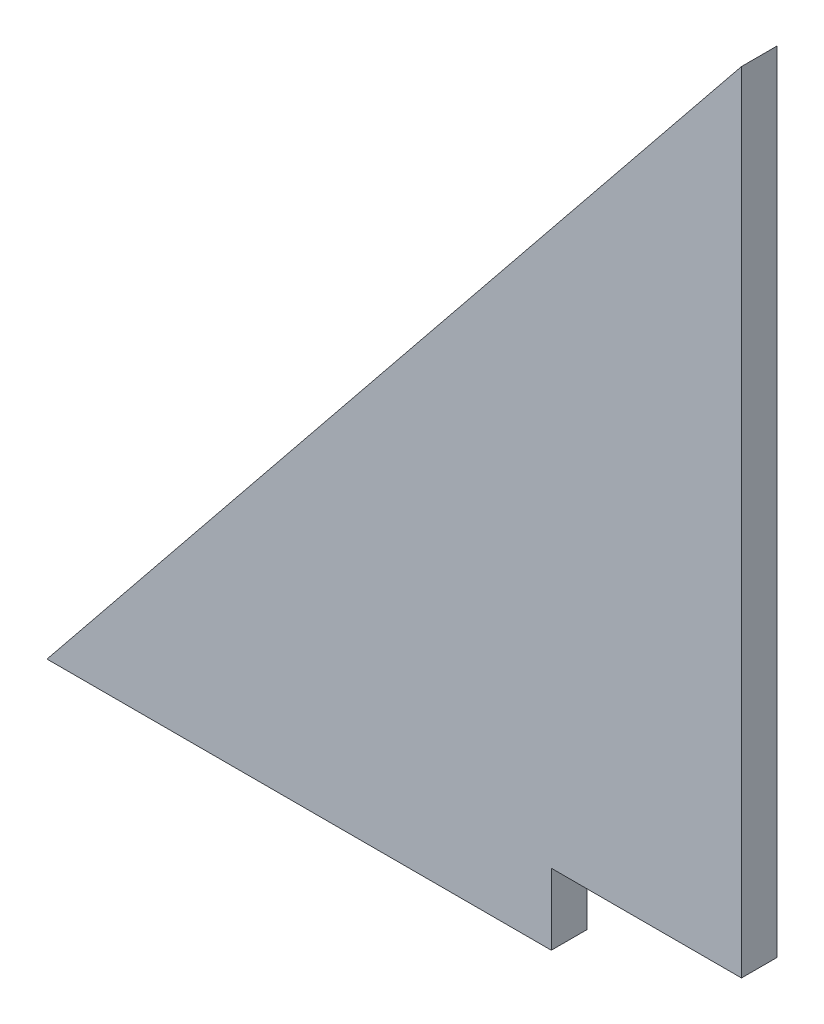
ISO-10303-21;
HEADER;
FILE_DESCRIPTION(('STEP AP214'),'2;1');
FILE_NAME('part.step','',(''),(''),'','','');
FILE_SCHEMA(('AUTOMOTIVE_DESIGN { 1 0 10303 214 1 1 1 1 }'));
ENDSEC;
DATA;
#1=APPLICATION_CONTEXT('core data for automotive mechanical design processes');
#2=APPLICATION_PROTOCOL_DEFINITION('international standard','automotive_design',2000,#1);
#3=PRODUCT_CONTEXT('',#1,'mechanical');
#4=PRODUCT('Part','Part','',(#3));
#5=PRODUCT_RELATED_PRODUCT_CATEGORY('part','',(#4));
#6=PRODUCT_DEFINITION_FORMATION('','',#4);
#7=PRODUCT_DEFINITION_CONTEXT('part definition',#1,'design');
#8=PRODUCT_DEFINITION('design','',#6,#7);
#9=PRODUCT_DEFINITION_SHAPE('','',#8);
#10=(LENGTH_UNIT() NAMED_UNIT(*) SI_UNIT(.MILLI.,.METRE.));
#11=(NAMED_UNIT(*) PLANE_ANGLE_UNIT() SI_UNIT($,.RADIAN.));
#12=(NAMED_UNIT(*) SI_UNIT($,.STERADIAN.) SOLID_ANGLE_UNIT());
#13=UNCERTAINTY_MEASURE_WITH_UNIT(LENGTH_MEASURE(1.E-05),#10,'distance_accuracy_value','');
#14=(GEOMETRIC_REPRESENTATION_CONTEXT(3) GLOBAL_UNCERTAINTY_ASSIGNED_CONTEXT((#13)) GLOBAL_UNIT_ASSIGNED_CONTEXT((#10,
#11,#12)) REPRESENTATION_CONTEXT('',''));
#15=CARTESIAN_POINT('',(0.,0.,0.));
#16=DIRECTION('',(0.,0.,1.));
#17=DIRECTION('',(1.,0.,0.));
#18=AXIS2_PLACEMENT_3D('',#15,#16,#17);
#19=CARTESIAN_POINT('',(0.0780344562762211,-36.9367393336946,3.175));
#20=DIRECTION('',(-1.,0.,0.));
#21=DIRECTION('',(0.,0.,1.));
#22=AXIS2_PLACEMENT_3D('',#19,#20,#21);
#23=PLANE('',#22);
#24=DIRECTION('',(0.,1.,0.));
#25=VECTOR('',#24,1.);
#26=CARTESIAN_POINT('',(0.0780344562762211,-36.9367393336946,0.));
#27=LINE('',#26,#25);
#28=CARTESIAN_POINT('',(0.0780344562762211,-36.9367393336946,0.));
#29=VERTEX_POINT('',#28);
#30=CARTESIAN_POINT('',(0.0780344562762211,33.6228260869565,0.));
#31=VERTEX_POINT('',#30);
#32=EDGE_CURVE('E112',#29,#31,#27,.T.);
#33=ORIENTED_EDGE('',*,*,#32,.T.);
#34=DIRECTION('',(0.,0.,-1.));
#35=VECTOR('',#34,1.);
#36=CARTESIAN_POINT('',(0.0780344562762211,33.6228260869565,3.175));
#37=LINE('',#36,#35);
#38=CARTESIAN_POINT('',(0.0780344562762211,33.6228260869565,3.175));
#39=VERTEX_POINT('',#38);
#40=EDGE_CURVE('E42',#39,#31,#37,.T.);
#41=ORIENTED_EDGE('',*,*,#40,.F.);
#42=DIRECTION('',(0.,1.,0.));
#43=VECTOR('',#42,1.);
#44=CARTESIAN_POINT('',(0.0780344562762211,-36.9367393336946,3.175));
#45=LINE('',#44,#43);
#46=CARTESIAN_POINT('',(0.0780344562762211,-36.9367393336946,3.175));
#47=VERTEX_POINT('',#46);
#48=EDGE_CURVE('E85',#47,#39,#45,.T.);
#49=ORIENTED_EDGE('',*,*,#48,.F.);
#50=DIRECTION('',(0.,0.,-1.));
#51=VECTOR('',#50,1.);
#52=CARTESIAN_POINT('',(0.0780344562762211,-36.9367393336946,3.175));
#53=LINE('',#52,#51);
#54=EDGE_CURVE('E11',#47,#29,#53,.T.);
#55=ORIENTED_EDGE('',*,*,#54,.T.);
#56=EDGE_LOOP('',(#33,#41,#49,#55));
#57=FACE_BOUND('',#56,.T.);
#58=ADVANCED_FACE('F34',(#57),#23,.F.);
#59=CARTESIAN_POINT('',(0.0780344562762211,33.6228260869565,3.175));
#60=DIRECTION('',(0.778151094490991,-0.628077124358524,0.));
#61=DIRECTION('',(0.628077124358524,0.778151094490991,0.));
#62=AXIS2_PLACEMENT_3D('',#59,#60,#61);
#63=PLANE('',#62);
#64=DIRECTION('',(-0.628077124358524,-0.778151094490991,0.));
#65=VECTOR('',#64,1.);
#66=CARTESIAN_POINT('',(0.0780344562762211,33.6228260869565,0.));
#67=LINE('',#66,#65);
#68=CARTESIAN_POINT('',(-62.,-43.2882547064052,0.));
#69=VERTEX_POINT('',#68);
#70=EDGE_CURVE('E101',#31,#69,#67,.T.);
#71=ORIENTED_EDGE('',*,*,#70,.T.);
#72=DIRECTION('',(0.,0.,-1.));
#73=VECTOR('',#72,1.);
#74=CARTESIAN_POINT('',(-62.,-43.2882547064052,3.175));
#75=LINE('',#74,#73);
#76=CARTESIAN_POINT('',(-62.,-43.2882547064052,3.175));
#77=VERTEX_POINT('',#76);
#78=EDGE_CURVE('E98',#77,#69,#75,.T.);
#79=ORIENTED_EDGE('',*,*,#78,.F.);
#80=DIRECTION('',(-0.628077124358524,-0.778151094490991,0.));
#81=VECTOR('',#80,1.);
#82=CARTESIAN_POINT('',(0.0780344562762211,33.6228260869565,3.175));
#83=LINE('',#82,#81);
#84=EDGE_CURVE('E90',#39,#77,#83,.T.);
#85=ORIENTED_EDGE('',*,*,#84,.F.);
#86=ORIENTED_EDGE('',*,*,#40,.T.);
#87=EDGE_LOOP('',(#71,#79,#85,#86));
#88=FACE_BOUND('',#87,.T.);
#89=ADVANCED_FACE('F99',(#88),#63,.F.);
#90=CARTESIAN_POINT('',(-16.9214670963224,-43.2882547064052,3.175));
#91=DIRECTION('',(0.,1.,0.));
#92=DIRECTION('',(0.,0.,1.));
#93=AXIS2_PLACEMENT_3D('',#90,#91,#92);
#94=PLANE('',#93);
#95=DIRECTION('',(1.,0.,0.));
#96=VECTOR('',#95,1.);
#97=CARTESIAN_POINT('',(-16.9214670963224,-43.2882547064052,0.));
#98=LINE('',#97,#96);
#99=CARTESIAN_POINT('',(-16.9214670963224,-43.2882547064052,0.));
#100=VERTEX_POINT('',#99);
#101=EDGE_CURVE('E71',#69,#100,#98,.T.);
#102=ORIENTED_EDGE('',*,*,#101,.T.);
#103=DIRECTION('',(0.,0.,-1.));
#104=VECTOR('',#103,1.);
#105=CARTESIAN_POINT('',(-16.9214670963224,-43.2882547064052,3.175));
#106=LINE('',#105,#104);
#107=CARTESIAN_POINT('',(-16.9214670963224,-43.2882547064052,3.175));
#108=VERTEX_POINT('',#107);
#109=EDGE_CURVE('E102',#108,#100,#106,.T.);
#110=ORIENTED_EDGE('',*,*,#109,.F.);
#111=DIRECTION('',(1.,0.,0.));
#112=VECTOR('',#111,1.);
#113=CARTESIAN_POINT('',(-16.9214670963224,-43.2882547064052,3.175));
#114=LINE('',#113,#112);
#115=EDGE_CURVE('E94',#77,#108,#114,.T.);
#116=ORIENTED_EDGE('',*,*,#115,.F.);
#117=ORIENTED_EDGE('',*,*,#78,.T.);
#118=EDGE_LOOP('',(#102,#110,#116,#117));
#119=FACE_BOUND('',#118,.T.);
#120=ADVANCED_FACE('F104',(#119),#94,.F.);
#121=CARTESIAN_POINT('',(-16.9214670963224,-36.9367393336946,3.175));
#122=DIRECTION('',(-1.,0.,0.));
#123=DIRECTION('',(0.,0.,1.));
#124=AXIS2_PLACEMENT_3D('',#121,#122,#123);
#125=PLANE('',#124);
#126=DIRECTION('',(0.,1.,0.));
#127=VECTOR('',#126,1.);
#128=CARTESIAN_POINT('',(-16.9214670963224,-36.9367393336946,0.));
#129=LINE('',#128,#127);
#130=CARTESIAN_POINT('',(-16.9214670963224,-36.9367393336946,0.));
#131=VERTEX_POINT('',#130);
#132=EDGE_CURVE('E78',#100,#131,#129,.T.);
#133=ORIENTED_EDGE('',*,*,#132,.T.);
#134=DIRECTION('',(0.,0.,-1.));
#135=VECTOR('',#134,1.);
#136=CARTESIAN_POINT('',(-16.9214670963224,-36.9367393336946,3.175));
#137=LINE('',#136,#135);
#138=CARTESIAN_POINT('',(-16.9214670963224,-36.9367393336946,3.175));
#139=VERTEX_POINT('',#138);
#140=EDGE_CURVE('E108',#139,#131,#137,.T.);
#141=ORIENTED_EDGE('',*,*,#140,.F.);
#142=DIRECTION('',(0.,1.,0.));
#143=VECTOR('',#142,1.);
#144=CARTESIAN_POINT('',(-16.9214670963224,-36.9367393336946,3.175));
#145=LINE('',#144,#143);
#146=EDGE_CURVE('E106',#108,#139,#145,.T.);
#147=ORIENTED_EDGE('',*,*,#146,.F.);
#148=ORIENTED_EDGE('',*,*,#109,.T.);
#149=EDGE_LOOP('',(#133,#141,#147,#148));
#150=FACE_BOUND('',#149,.T.);
#151=ADVANCED_FACE('F125',(#150),#125,.F.);
#152=CARTESIAN_POINT('',(-16.826988173864,-36.9367393336946,3.175));
#153=DIRECTION('',(0.,1.,0.));
#154=DIRECTION('',(0.,0.,1.));
#155=AXIS2_PLACEMENT_3D('',#152,#153,#154);
#156=PLANE('',#155);
#157=DIRECTION('',(1.,0.,0.));
#158=VECTOR('',#157,1.);
#159=CARTESIAN_POINT('',(-16.826988173864,-36.9367393336946,0.));
#160=LINE('',#159,#158);
#161=EDGE_CURVE('E117',#131,#29,#160,.T.);
#162=ORIENTED_EDGE('',*,*,#161,.T.);
#163=ORIENTED_EDGE('',*,*,#54,.F.);
#164=DIRECTION('',(1.,0.,0.));
#165=VECTOR('',#164,1.);
#166=CARTESIAN_POINT('',(-16.826988173864,-36.9367393336946,3.175));
#167=LINE('',#166,#165);
#168=EDGE_CURVE('E50',#139,#47,#167,.T.);
#169=ORIENTED_EDGE('',*,*,#168,.F.);
#170=ORIENTED_EDGE('',*,*,#140,.T.);
#171=EDGE_LOOP('',(#162,#163,#169,#170));
#172=FACE_BOUND('',#171,.T.);
#173=ADVANCED_FACE('F124',(#172),#156,.F.);
#174=CARTESIAN_POINT('',(0.,0.,3.175));
#175=DIRECTION('',(0.,0.,1.));
#176=DIRECTION('',(1.,0.,0.));
#177=AXIS2_PLACEMENT_3D('',#174,#175,#176);
#178=PLANE('',#177);
#179=ORIENTED_EDGE('',*,*,#168,.T.);
#180=ORIENTED_EDGE('',*,*,#48,.T.);
#181=ORIENTED_EDGE('',*,*,#84,.T.);
#182=ORIENTED_EDGE('',*,*,#115,.T.);
#183=ORIENTED_EDGE('',*,*,#146,.T.);
#184=EDGE_LOOP('',(#179,#180,#181,#182,#183));
#185=FACE_BOUND('',#184,.T.);
#186=ADVANCED_FACE('F92',(#185),#178,.T.);
#187=CARTESIAN_POINT('',(0.,0.,0.));
#188=DIRECTION('',(0.,0.,1.));
#189=DIRECTION('',(1.,0.,0.));
#190=AXIS2_PLACEMENT_3D('',#187,#188,#189);
#191=PLANE('',#190);
#192=ORIENTED_EDGE('',*,*,#32,.F.);
#193=ORIENTED_EDGE('',*,*,#161,.F.);
#194=ORIENTED_EDGE('',*,*,#132,.F.);
#195=ORIENTED_EDGE('',*,*,#101,.F.);
#196=ORIENTED_EDGE('',*,*,#70,.F.);
#197=EDGE_LOOP('',(#192,#193,#194,#195,#196));
#198=FACE_BOUND('',#197,.T.);
#199=ADVANCED_FACE('F122',(#198),#191,.F.);
#200=CLOSED_SHELL('',(#58,#89,#120,#151,#173,#186,#199));
#201=MANIFOLD_SOLID_BREP('B2',#200);
#202=ADVANCED_BREP_SHAPE_REPRESENTATION('',(#18,#201),#14);
#203=SHAPE_DEFINITION_REPRESENTATION(#9,#202);
ENDSEC;
END-ISO-10303-21;
